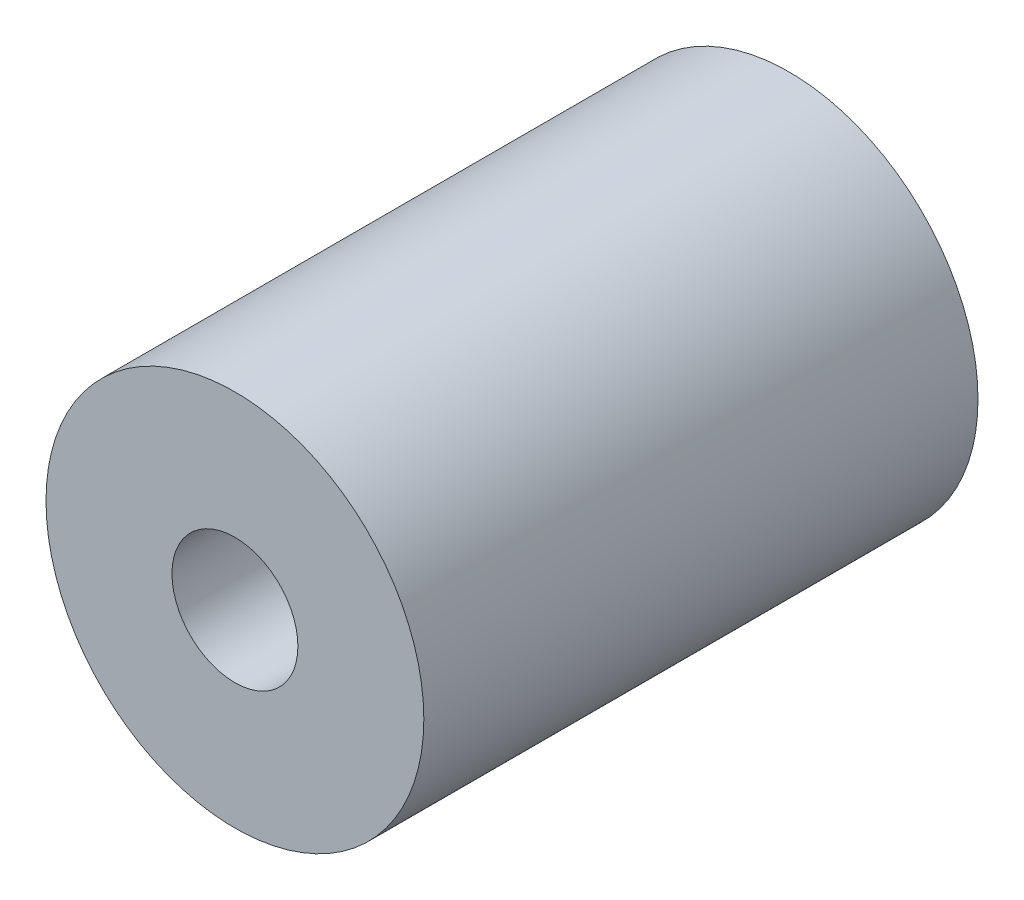
ISO-10303-21;
HEADER;
FILE_DESCRIPTION(('STEP AP214'),'2;1');
FILE_NAME('part.step','',(''),(''),'','','');
FILE_SCHEMA(('AUTOMOTIVE_DESIGN { 1 0 10303 214 1 1 1 1 }'));
ENDSEC;
DATA;
#1=APPLICATION_CONTEXT('core data for automotive mechanical design processes');
#2=APPLICATION_PROTOCOL_DEFINITION('international standard','automotive_design',2000,#1);
#3=PRODUCT_CONTEXT('',#1,'mechanical');
#4=PRODUCT('Part','Part','',(#3));
#5=PRODUCT_RELATED_PRODUCT_CATEGORY('part','',(#4));
#6=PRODUCT_DEFINITION_FORMATION('','',#4);
#7=PRODUCT_DEFINITION_CONTEXT('part definition',#1,'design');
#8=PRODUCT_DEFINITION('design','',#6,#7);
#9=PRODUCT_DEFINITION_SHAPE('','',#8);
#10=(LENGTH_UNIT() NAMED_UNIT(*) SI_UNIT(.MILLI.,.METRE.));
#11=(NAMED_UNIT(*) PLANE_ANGLE_UNIT() SI_UNIT($,.RADIAN.));
#12=(NAMED_UNIT(*) SI_UNIT($,.STERADIAN.) SOLID_ANGLE_UNIT());
#13=UNCERTAINTY_MEASURE_WITH_UNIT(LENGTH_MEASURE(1.E-05),#10,'distance_accuracy_value','');
#14=(GEOMETRIC_REPRESENTATION_CONTEXT(3) GLOBAL_UNCERTAINTY_ASSIGNED_CONTEXT((#13)) GLOBAL_UNIT_ASSIGNED_CONTEXT((#10,
#11,#12)) REPRESENTATION_CONTEXT('',''));
#15=CARTESIAN_POINT('',(0.,0.,0.));
#16=DIRECTION('',(0.,0.,1.));
#17=DIRECTION('',(1.,0.,0.));
#18=AXIS2_PLACEMENT_3D('',#15,#16,#17);
#19=CARTESIAN_POINT('',(0.,0.,27.94));
#20=DIRECTION('',(0.,0.,-1.));
#21=DIRECTION('',(-1.,0.,0.));
#22=AXIS2_PLACEMENT_3D('',#19,#20,#21);
#23=CYLINDRICAL_SURFACE('',#22,3.175);
#24=CARTESIAN_POINT('',(0.,0.,27.94));
#25=DIRECTION('',(0.,0.,1.));
#26=DIRECTION('',(1.,0.,0.));
#27=AXIS2_PLACEMENT_3D('',#24,#25,#26);
#28=CIRCLE('',#27,3.175);
#29=CARTESIAN_POINT('',(3.175,0.,27.94));
#30=VERTEX_POINT('',#29);
#31=EDGE_CURVE('E41',#30,#30,#28,.T.);
#32=ORIENTED_EDGE('',*,*,#31,.T.);
#33=EDGE_LOOP('',(#32));
#34=FACE_BOUND('',#33,.T.);
#35=CARTESIAN_POINT('',(0.,0.,6.5024));
#36=DIRECTION('',(0.,0.,-1.));
#37=DIRECTION('',(-1.,0.,0.));
#38=AXIS2_PLACEMENT_3D('',#35,#36,#37);
#39=CIRCLE('',#38,3.175);
#40=CARTESIAN_POINT('',(-3.175,0.,6.5024));
#41=VERTEX_POINT('',#40);
#42=EDGE_CURVE('E49',#41,#41,#39,.F.);
#43=ORIENTED_EDGE('',*,*,#42,.F.);
#44=EDGE_LOOP('',(#43));
#45=FACE_BOUND('',#44,.T.);
#46=ADVANCED_FACE('F30',(#34,#45),#23,.F.);
#47=CARTESIAN_POINT('',(0.,0.,27.94));
#48=DIRECTION('',(0.,0.,1.));
#49=DIRECTION('',(1.,0.,0.));
#50=AXIS2_PLACEMENT_3D('',#47,#48,#49);
#51=PLANE('',#50);
#52=CARTESIAN_POINT('',(0.,0.,27.94));
#53=DIRECTION('',(0.,0.,1.));
#54=DIRECTION('',(1.,0.,0.));
#55=AXIS2_PLACEMENT_3D('',#52,#53,#54);
#56=CIRCLE('',#55,9.525);
#57=CARTESIAN_POINT('',(9.525,0.,27.94));
#58=VERTEX_POINT('',#57);
#59=EDGE_CURVE('E10',#58,#58,#56,.T.);
#60=ORIENTED_EDGE('',*,*,#59,.T.);
#61=EDGE_LOOP('',(#60));
#62=FACE_BOUND('',#61,.T.);
#63=ORIENTED_EDGE('',*,*,#31,.F.);
#64=EDGE_LOOP('',(#63));
#65=FACE_BOUND('',#64,.T.);
#66=ADVANCED_FACE('F59',(#62,#65),#51,.T.);
#67=CARTESIAN_POINT('',(0.,0.,0.));
#68=DIRECTION('',(0.,0.,1.));
#69=DIRECTION('',(1.,0.,0.));
#70=AXIS2_PLACEMENT_3D('',#67,#68,#69);
#71=PLANE('',#70);
#72=CARTESIAN_POINT('',(0.,0.,0.));
#73=DIRECTION('',(0.,0.,-1.));
#74=DIRECTION('',(-1.,0.,0.));
#75=AXIS2_PLACEMENT_3D('',#72,#73,#74);
#76=CIRCLE('',#75,4.7625);
#77=CARTESIAN_POINT('',(-4.7625,0.,0.));
#78=VERTEX_POINT('',#77);
#79=EDGE_CURVE('E46',#78,#78,#76,.T.);
#80=ORIENTED_EDGE('',*,*,#79,.F.);
#81=EDGE_LOOP('',(#80));
#82=FACE_BOUND('',#81,.T.);
#83=CARTESIAN_POINT('',(0.,0.,0.));
#84=DIRECTION('',(0.,0.,1.));
#85=DIRECTION('',(1.,0.,0.));
#86=AXIS2_PLACEMENT_3D('',#83,#84,#85);
#87=CIRCLE('',#86,9.525);
#88=CARTESIAN_POINT('',(9.525,0.,0.));
#89=VERTEX_POINT('',#88);
#90=EDGE_CURVE('E34',#89,#89,#87,.T.);
#91=ORIENTED_EDGE('',*,*,#90,.F.);
#92=EDGE_LOOP('',(#91));
#93=FACE_BOUND('',#92,.T.);
#94=ADVANCED_FACE('F65',(#82,#93),#71,.F.);
#95=CARTESIAN_POINT('',(0.,0.,27.94));
#96=DIRECTION('',(0.,0.,-1.));
#97=DIRECTION('',(-1.,0.,0.));
#98=AXIS2_PLACEMENT_3D('',#95,#96,#97);
#99=CYLINDRICAL_SURFACE('',#98,9.525);
#100=ORIENTED_EDGE('',*,*,#59,.F.);
#101=EDGE_LOOP('',(#100));
#102=FACE_BOUND('',#101,.T.);
#103=ORIENTED_EDGE('',*,*,#90,.T.);
#104=EDGE_LOOP('',(#103));
#105=FACE_BOUND('',#104,.T.);
#106=ADVANCED_FACE('F32',(#102,#105),#99,.T.);
#107=CARTESIAN_POINT('',(0.,0.,6.5024));
#108=DIRECTION('',(0.,0.,-1.));
#109=DIRECTION('',(-1.,0.,0.));
#110=AXIS2_PLACEMENT_3D('',#107,#108,#109);
#111=CYLINDRICAL_SURFACE('',#110,4.7625);
#112=CARTESIAN_POINT('',(0.,0.,6.5024));
#113=DIRECTION('',(0.,0.,-1.));
#114=DIRECTION('',(-1.,0.,0.));
#115=AXIS2_PLACEMENT_3D('',#112,#113,#114);
#116=CIRCLE('',#115,4.7625);
#117=CARTESIAN_POINT('',(-4.7625,0.,6.5024));
#118=VERTEX_POINT('',#117);
#119=EDGE_CURVE('E45',#118,#118,#116,.T.);
#120=ORIENTED_EDGE('',*,*,#119,.F.);
#121=EDGE_LOOP('',(#120));
#122=FACE_BOUND('',#121,.T.);
#123=ORIENTED_EDGE('',*,*,#79,.T.);
#124=EDGE_LOOP('',(#123));
#125=FACE_BOUND('',#124,.T.);
#126=ADVANCED_FACE('F68',(#122,#125),#111,.F.);
#127=CARTESIAN_POINT('',(0.,0.,6.5024));
#128=DIRECTION('',(0.,0.,-1.));
#129=DIRECTION('',(-1.,0.,0.));
#130=AXIS2_PLACEMENT_3D('',#127,#128,#129);
#131=PLANE('',#130);
#132=ORIENTED_EDGE('',*,*,#42,.T.);
#133=EDGE_LOOP('',(#132));
#134=FACE_BOUND('',#133,.T.);
#135=ORIENTED_EDGE('',*,*,#119,.T.);
#136=EDGE_LOOP('',(#135));
#137=FACE_BOUND('',#136,.T.);
#138=ADVANCED_FACE('F55',(#134,#137),#131,.T.);
#139=CLOSED_SHELL('',(#46,#66,#94,#106,#126,#138));
#140=MANIFOLD_SOLID_BREP('B2',#139);
#141=ADVANCED_BREP_SHAPE_REPRESENTATION('',(#18,#140),#14);
#142=SHAPE_DEFINITION_REPRESENTATION(#9,#141);
ENDSEC;
END-ISO-10303-21;
